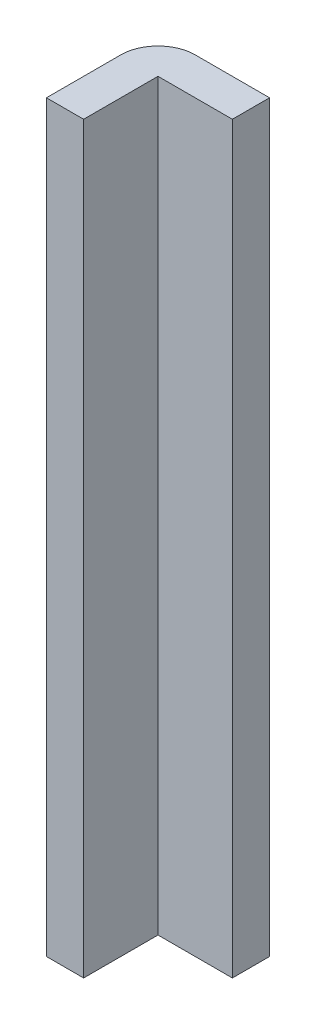
ISO-10303-21;
HEADER;
FILE_DESCRIPTION(('STEP AP214'),'2;1');
FILE_NAME('part.step','',(''),(''),'','','');
FILE_SCHEMA(('AUTOMOTIVE_DESIGN { 1 0 10303 214 1 1 1 1 }'));
ENDSEC;
DATA;
#1=APPLICATION_CONTEXT('core data for automotive mechanical design processes');
#2=APPLICATION_PROTOCOL_DEFINITION('international standard','automotive_design',2000,#1);
#3=PRODUCT_CONTEXT('',#1,'mechanical');
#4=PRODUCT('Part','Part','',(#3));
#5=PRODUCT_RELATED_PRODUCT_CATEGORY('part','',(#4));
#6=PRODUCT_DEFINITION_FORMATION('','',#4);
#7=PRODUCT_DEFINITION_CONTEXT('part definition',#1,'design');
#8=PRODUCT_DEFINITION('design','',#6,#7);
#9=PRODUCT_DEFINITION_SHAPE('','',#8);
#10=(LENGTH_UNIT() NAMED_UNIT(*) SI_UNIT(.MILLI.,.METRE.));
#11=(NAMED_UNIT(*) PLANE_ANGLE_UNIT() SI_UNIT($,.RADIAN.));
#12=(NAMED_UNIT(*) SI_UNIT($,.STERADIAN.) SOLID_ANGLE_UNIT());
#13=UNCERTAINTY_MEASURE_WITH_UNIT(LENGTH_MEASURE(1.E-05),#10,'distance_accuracy_value','');
#14=(GEOMETRIC_REPRESENTATION_CONTEXT(3) GLOBAL_UNCERTAINTY_ASSIGNED_CONTEXT((#13)) GLOBAL_UNIT_ASSIGNED_CONTEXT((#10,
#11,#12)) REPRESENTATION_CONTEXT('',''));
#15=CARTESIAN_POINT('',(0.,0.,0.));
#16=DIRECTION('',(0.,0.,1.));
#17=DIRECTION('',(1.,0.,0.));
#18=AXIS2_PLACEMENT_3D('',#15,#16,#17);
#19=CARTESIAN_POINT('',(-2.,40.,-6.));
#20=DIRECTION('',(0.,0.,1.));
#21=DIRECTION('',(1.,0.,0.));
#22=AXIS2_PLACEMENT_3D('',#19,#20,#21);
#23=PLANE('',#22);
#24=DIRECTION('',(-1.,0.,0.));
#25=VECTOR('',#24,1.);
#26=CARTESIAN_POINT('',(-2.,0.,-6.));
#27=LINE('',#26,#25);
#28=CARTESIAN_POINT('',(4.,0.,-6.));
#29=VERTEX_POINT('',#28);
#30=CARTESIAN_POINT('',(0.,0.,-6.));
#31=VERTEX_POINT('',#30);
#32=EDGE_CURVE('E145',#29,#31,#27,.T.);
#33=ORIENTED_EDGE('',*,*,#32,.T.);
#34=DIRECTION('',(0.,-1.,0.));
#35=VECTOR('',#34,1.);
#36=CARTESIAN_POINT('',(0.,40.,-6.));
#37=LINE('',#36,#35);
#38=CARTESIAN_POINT('',(0.,40.,-6.));
#39=VERTEX_POINT('',#38);
#40=EDGE_CURVE('E54',#31,#39,#37,.F.);
#41=ORIENTED_EDGE('',*,*,#40,.T.);
#42=DIRECTION('',(-1.,0.,0.));
#43=VECTOR('',#42,1.);
#44=CARTESIAN_POINT('',(-2.,40.,-6.));
#45=LINE('',#44,#43);
#46=CARTESIAN_POINT('',(4.,40.,-6.));
#47=VERTEX_POINT('',#46);
#48=EDGE_CURVE('E115',#47,#39,#45,.T.);
#49=ORIENTED_EDGE('',*,*,#48,.F.);
#50=DIRECTION('',(0.,-1.,0.));
#51=VECTOR('',#50,1.);
#52=CARTESIAN_POINT('',(4.,40.,-6.));
#53=LINE('',#52,#51);
#54=EDGE_CURVE('E144',#47,#29,#53,.T.);
#55=ORIENTED_EDGE('',*,*,#54,.T.);
#56=EDGE_LOOP('',(#33,#41,#49,#55));
#57=FACE_BOUND('',#56,.T.);
#58=ADVANCED_FACE('F45',(#57),#23,.F.);
#59=CARTESIAN_POINT('',(-2.,40.,0.));
#60=DIRECTION('',(1.,0.,0.));
#61=DIRECTION('',(0.,0.,-1.));
#62=AXIS2_PLACEMENT_3D('',#59,#60,#61);
#63=PLANE('',#62);
#64=DIRECTION('',(0.,0.,1.));
#65=VECTOR('',#64,1.);
#66=CARTESIAN_POINT('',(-2.,40.,0.));
#67=LINE('',#66,#65);
#68=CARTESIAN_POINT('',(-2.,40.,-4.));
#69=VERTEX_POINT('',#68);
#70=CARTESIAN_POINT('',(-2.,40.,0.));
#71=VERTEX_POINT('',#70);
#72=EDGE_CURVE('E104',#69,#71,#67,.T.);
#73=ORIENTED_EDGE('',*,*,#72,.F.);
#74=DIRECTION('',(0.,-1.,0.));
#75=VECTOR('',#74,1.);
#76=CARTESIAN_POINT('',(-2.,40.,-4.));
#77=LINE('',#76,#75);
#78=CARTESIAN_POINT('',(-2.,0.,-4.));
#79=VERTEX_POINT('',#78);
#80=EDGE_CURVE('E125',#69,#79,#77,.T.);
#81=ORIENTED_EDGE('',*,*,#80,.T.);
#82=DIRECTION('',(0.,0.,1.));
#83=VECTOR('',#82,1.);
#84=CARTESIAN_POINT('',(-2.,0.,0.));
#85=LINE('',#84,#83);
#86=CARTESIAN_POINT('',(-2.,0.,0.));
#87=VERTEX_POINT('',#86);
#88=EDGE_CURVE('E120',#79,#87,#85,.T.);
#89=ORIENTED_EDGE('',*,*,#88,.T.);
#90=DIRECTION('',(0.,-1.,0.));
#91=VECTOR('',#90,1.);
#92=CARTESIAN_POINT('',(-2.,40.,0.));
#93=LINE('',#92,#91);
#94=EDGE_CURVE('E118',#71,#87,#93,.T.);
#95=ORIENTED_EDGE('',*,*,#94,.F.);
#96=EDGE_LOOP('',(#73,#81,#89,#95));
#97=FACE_BOUND('',#96,.T.);
#98=ADVANCED_FACE('F119',(#97),#63,.F.);
#99=CARTESIAN_POINT('',(0.,40.,0.));
#100=DIRECTION('',(0.,0.,-1.));
#101=DIRECTION('',(-1.,0.,0.));
#102=AXIS2_PLACEMENT_3D('',#99,#100,#101);
#103=PLANE('',#102);
#104=DIRECTION('',(1.,0.,0.));
#105=VECTOR('',#104,1.);
#106=CARTESIAN_POINT('',(0.,0.,0.));
#107=LINE('',#106,#105);
#108=CARTESIAN_POINT('',(0.,0.,0.));
#109=VERTEX_POINT('',#108);
#110=EDGE_CURVE('E150',#87,#109,#107,.T.);
#111=ORIENTED_EDGE('',*,*,#110,.T.);
#112=DIRECTION('',(0.,-1.,0.));
#113=VECTOR('',#112,1.);
#114=CARTESIAN_POINT('',(0.,40.,0.));
#115=LINE('',#114,#113);
#116=CARTESIAN_POINT('',(0.,40.,0.));
#117=VERTEX_POINT('',#116);
#118=EDGE_CURVE('E126',#117,#109,#115,.T.);
#119=ORIENTED_EDGE('',*,*,#118,.F.);
#120=DIRECTION('',(1.,0.,0.));
#121=VECTOR('',#120,1.);
#122=CARTESIAN_POINT('',(0.,40.,0.));
#123=LINE('',#122,#121);
#124=EDGE_CURVE('E108',#71,#117,#123,.T.);
#125=ORIENTED_EDGE('',*,*,#124,.F.);
#126=ORIENTED_EDGE('',*,*,#94,.T.);
#127=EDGE_LOOP('',(#111,#119,#125,#126));
#128=FACE_BOUND('',#127,.T.);
#129=ADVANCED_FACE('F128',(#128),#103,.F.);
#130=CARTESIAN_POINT('',(0.,40.,-0.889632107023412));
#131=DIRECTION('',(-1.,0.,0.));
#132=DIRECTION('',(0.,0.,1.));
#133=AXIS2_PLACEMENT_3D('',#130,#131,#132);
#134=PLANE('',#133);
#135=DIRECTION('',(0.,0.,-1.));
#136=VECTOR('',#135,1.);
#137=CARTESIAN_POINT('',(0.,0.,-0.889632107023412));
#138=LINE('',#137,#136);
#139=CARTESIAN_POINT('',(0.,0.,-4.));
#140=VERTEX_POINT('',#139);
#141=EDGE_CURVE('E153',#109,#140,#138,.T.);
#142=ORIENTED_EDGE('',*,*,#141,.T.);
#143=DIRECTION('',(0.,-1.,0.));
#144=VECTOR('',#143,1.);
#145=CARTESIAN_POINT('',(0.,40.,-4.));
#146=LINE('',#145,#144);
#147=CARTESIAN_POINT('',(0.,40.,-4.));
#148=VERTEX_POINT('',#147);
#149=EDGE_CURVE('E169',#148,#140,#146,.T.);
#150=ORIENTED_EDGE('',*,*,#149,.F.);
#151=DIRECTION('',(0.,0.,-1.));
#152=VECTOR('',#151,1.);
#153=CARTESIAN_POINT('',(0.,40.,0.));
#154=LINE('',#153,#152);
#155=EDGE_CURVE('E132',#117,#148,#154,.T.);
#156=ORIENTED_EDGE('',*,*,#155,.F.);
#157=ORIENTED_EDGE('',*,*,#118,.T.);
#158=EDGE_LOOP('',(#142,#150,#156,#157));
#159=FACE_BOUND('',#158,.T.);
#160=ADVANCED_FACE('F183',(#159),#134,.F.);
#161=CARTESIAN_POINT('',(0.,40.,-4.));
#162=DIRECTION('',(0.,0.,-1.));
#163=DIRECTION('',(-1.,0.,0.));
#164=AXIS2_PLACEMENT_3D('',#161,#162,#163);
#165=PLANE('',#164);
#166=DIRECTION('',(1.,0.,0.));
#167=VECTOR('',#166,1.);
#168=CARTESIAN_POINT('',(0.,0.,-4.));
#169=LINE('',#168,#167);
#170=CARTESIAN_POINT('',(4.,0.,-4.));
#171=VERTEX_POINT('',#170);
#172=EDGE_CURVE('E156',#140,#171,#169,.T.);
#173=ORIENTED_EDGE('',*,*,#172,.T.);
#174=DIRECTION('',(0.,-1.,0.));
#175=VECTOR('',#174,1.);
#176=CARTESIAN_POINT('',(4.,40.,-4.));
#177=LINE('',#176,#175);
#178=CARTESIAN_POINT('',(4.,40.,-4.));
#179=VERTEX_POINT('',#178);
#180=EDGE_CURVE('E165',#179,#171,#177,.T.);
#181=ORIENTED_EDGE('',*,*,#180,.F.);
#182=DIRECTION('',(1.,0.,0.));
#183=VECTOR('',#182,1.);
#184=CARTESIAN_POINT('',(0.,40.,-4.));
#185=LINE('',#184,#183);
#186=EDGE_CURVE('E135',#148,#179,#185,.T.);
#187=ORIENTED_EDGE('',*,*,#186,.F.);
#188=ORIENTED_EDGE('',*,*,#149,.T.);
#189=EDGE_LOOP('',(#173,#181,#187,#188));
#190=FACE_BOUND('',#189,.T.);
#191=ADVANCED_FACE('F190',(#190),#165,.F.);
#192=CARTESIAN_POINT('',(4.,40.,-6.));
#193=DIRECTION('',(-1.,0.,0.));
#194=DIRECTION('',(0.,0.,1.));
#195=AXIS2_PLACEMENT_3D('',#192,#193,#194);
#196=PLANE('',#195);
#197=DIRECTION('',(0.,0.,-1.));
#198=VECTOR('',#197,1.);
#199=CARTESIAN_POINT('',(4.,0.,-6.));
#200=LINE('',#199,#198);
#201=EDGE_CURVE('E159',#171,#29,#200,.T.);
#202=ORIENTED_EDGE('',*,*,#201,.T.);
#203=ORIENTED_EDGE('',*,*,#54,.F.);
#204=DIRECTION('',(0.,0.,-1.));
#205=VECTOR('',#204,1.);
#206=CARTESIAN_POINT('',(4.,40.,-6.));
#207=LINE('',#206,#205);
#208=EDGE_CURVE('E141',#179,#47,#207,.T.);
#209=ORIENTED_EDGE('',*,*,#208,.F.);
#210=ORIENTED_EDGE('',*,*,#180,.T.);
#211=EDGE_LOOP('',(#202,#203,#209,#210));
#212=FACE_BOUND('',#211,.T.);
#213=ADVANCED_FACE('F193',(#212),#196,.F.);
#214=CARTESIAN_POINT('',(0.,40.,0.));
#215=DIRECTION('',(0.,-1.,0.));
#216=DIRECTION('',(0.,0.,-1.));
#217=AXIS2_PLACEMENT_3D('',#214,#215,#216);
#218=PLANE('',#217);
#219=ORIENTED_EDGE('',*,*,#48,.T.);
#220=CARTESIAN_POINT('',(0.,40.,-4.));
#221=DIRECTION('',(0.,-1.,0.));
#222=DIRECTION('',(0.,0.,-1.));
#223=AXIS2_PLACEMENT_3D('',#220,#221,#222);
#224=CIRCLE('',#223,2.);
#225=EDGE_CURVE('E11',#39,#69,#224,.F.);
#226=ORIENTED_EDGE('',*,*,#225,.T.);
#227=ORIENTED_EDGE('',*,*,#72,.T.);
#228=ORIENTED_EDGE('',*,*,#124,.T.);
#229=ORIENTED_EDGE('',*,*,#155,.T.);
#230=ORIENTED_EDGE('',*,*,#186,.T.);
#231=ORIENTED_EDGE('',*,*,#208,.T.);
#232=EDGE_LOOP('',(#219,#226,#227,#228,#229,#230,#231));
#233=FACE_BOUND('',#232,.T.);
#234=ADVANCED_FACE('F106',(#233),#218,.F.);
#235=CARTESIAN_POINT('',(0.,0.,0.));
#236=DIRECTION('',(0.,-1.,0.));
#237=DIRECTION('',(0.,0.,-1.));
#238=AXIS2_PLACEMENT_3D('',#235,#236,#237);
#239=PLANE('',#238);
#240=ORIENTED_EDGE('',*,*,#88,.F.);
#241=CARTESIAN_POINT('',(0.,0.,-4.));
#242=DIRECTION('',(0.,-1.,0.));
#243=DIRECTION('',(0.,0.,-1.));
#244=AXIS2_PLACEMENT_3D('',#241,#242,#243);
#245=CIRCLE('',#244,2.);
#246=EDGE_CURVE('E68',#79,#31,#245,.T.);
#247=ORIENTED_EDGE('',*,*,#246,.T.);
#248=ORIENTED_EDGE('',*,*,#32,.F.);
#249=ORIENTED_EDGE('',*,*,#201,.F.);
#250=ORIENTED_EDGE('',*,*,#172,.F.);
#251=ORIENTED_EDGE('',*,*,#141,.F.);
#252=ORIENTED_EDGE('',*,*,#110,.F.);
#253=EDGE_LOOP('',(#240,#247,#248,#249,#250,#251,#252));
#254=FACE_BOUND('',#253,.T.);
#255=ADVANCED_FACE('F180',(#254),#239,.T.);
#256=CARTESIAN_POINT('',(0.,40.,-4.));
#257=DIRECTION('',(0.,-1.,0.));
#258=DIRECTION('',(0.,0.,-1.));
#259=AXIS2_PLACEMENT_3D('',#256,#257,#258);
#260=CYLINDRICAL_SURFACE('',#259,2.);
#261=ORIENTED_EDGE('',*,*,#225,.F.);
#262=ORIENTED_EDGE('',*,*,#40,.F.);
#263=ORIENTED_EDGE('',*,*,#246,.F.);
#264=ORIENTED_EDGE('',*,*,#80,.F.);
#265=EDGE_LOOP('',(#261,#262,#263,#264));
#266=FACE_BOUND('',#265,.T.);
#267=ADVANCED_FACE('F47',(#266),#260,.T.);
#268=CLOSED_SHELL('',(#58,#98,#129,#160,#191,#213,#234,#255,#267));
#269=MANIFOLD_SOLID_BREP('B2',#268);
#270=ADVANCED_BREP_SHAPE_REPRESENTATION('',(#18,#269),#14);
#271=SHAPE_DEFINITION_REPRESENTATION(#9,#270);
ENDSEC;
END-ISO-10303-21;
